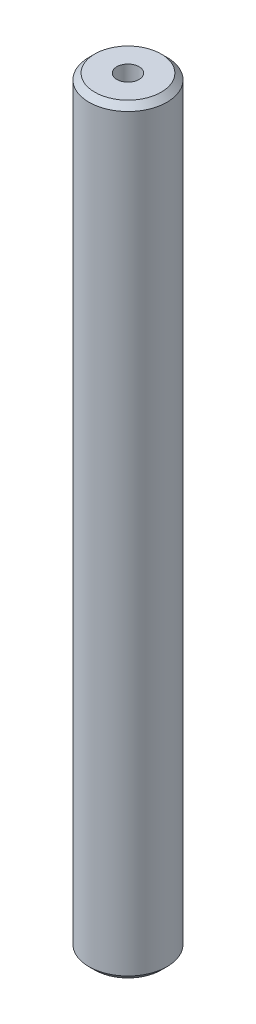
ISO-10303-21;
HEADER;
FILE_DESCRIPTION(('STEP AP214'),'2;1');
FILE_NAME('part.step','',(''),(''),'','','');
FILE_SCHEMA(('AUTOMOTIVE_DESIGN { 1 0 10303 214 1 1 1 1 }'));
ENDSEC;
DATA;
#1=APPLICATION_CONTEXT('core data for automotive mechanical design processes');
#2=APPLICATION_PROTOCOL_DEFINITION('international standard','automotive_design',2000,#1);
#3=PRODUCT_CONTEXT('',#1,'mechanical');
#4=PRODUCT('Part','Part','',(#3));
#5=PRODUCT_RELATED_PRODUCT_CATEGORY('part','',(#4));
#6=PRODUCT_DEFINITION_FORMATION('','',#4);
#7=PRODUCT_DEFINITION_CONTEXT('part definition',#1,'design');
#8=PRODUCT_DEFINITION('design','',#6,#7);
#9=PRODUCT_DEFINITION_SHAPE('','',#8);
#10=(LENGTH_UNIT() NAMED_UNIT(*) SI_UNIT(.MILLI.,.METRE.));
#11=(NAMED_UNIT(*) PLANE_ANGLE_UNIT() SI_UNIT($,.RADIAN.));
#12=(NAMED_UNIT(*) SI_UNIT($,.STERADIAN.) SOLID_ANGLE_UNIT());
#13=UNCERTAINTY_MEASURE_WITH_UNIT(LENGTH_MEASURE(1.E-05),#10,'distance_accuracy_value','');
#14=(GEOMETRIC_REPRESENTATION_CONTEXT(3) GLOBAL_UNCERTAINTY_ASSIGNED_CONTEXT((#13)) GLOBAL_UNIT_ASSIGNED_CONTEXT((#10,
#11,#12)) REPRESENTATION_CONTEXT('',''));
#15=CARTESIAN_POINT('',(0.,0.,0.));
#16=DIRECTION('',(0.,0.,1.));
#17=DIRECTION('',(1.,0.,0.));
#18=AXIS2_PLACEMENT_3D('',#15,#16,#17);
#19=CARTESIAN_POINT('',(0.,97.5659684433957,0.));
#20=DIRECTION('',(0.,-1.,0.));
#21=DIRECTION('',(0.,0.,-1.));
#22=AXIS2_PLACEMENT_3D('',#19,#20,#21);
#23=CYLINDRICAL_SURFACE('',#22,5.);
#24=CARTESIAN_POINT('',(0.,96.8245334853273,0.));
#25=DIRECTION('',(0.,1.,0.));
#26=DIRECTION('',(0.,0.,1.));
#27=AXIS2_PLACEMENT_3D('',#24,#25,#26);
#28=CIRCLE('',#27,5.);
#29=CARTESIAN_POINT('',(0.,96.8245334853273,5.));
#30=VERTEX_POINT('',#29);
#31=EDGE_CURVE('E50',#30,#30,#28,.F.);
#32=ORIENTED_EDGE('',*,*,#31,.T.);
#33=EDGE_LOOP('',(#32));
#34=FACE_BOUND('',#33,.T.);
#35=CARTESIAN_POINT('',(0.,0.741434958068429,0.));
#36=DIRECTION('',(0.,1.,0.));
#37=DIRECTION('',(0.,0.,1.));
#38=AXIS2_PLACEMENT_3D('',#35,#36,#37);
#39=CIRCLE('',#38,5.);
#40=CARTESIAN_POINT('',(0.,0.741434958068429,5.));
#41=VERTEX_POINT('',#40);
#42=EDGE_CURVE('E51',#41,#41,#39,.T.);
#43=ORIENTED_EDGE('',*,*,#42,.T.);
#44=EDGE_LOOP('',(#43));
#45=FACE_BOUND('',#44,.T.);
#46=ADVANCED_FACE('F39',(#34,#45),#23,.T.);
#47=CARTESIAN_POINT('',(0.,97.5659684433957,0.));
#48=DIRECTION('',(0.,1.,0.));
#49=DIRECTION('',(0.,0.,1.));
#50=AXIS2_PLACEMENT_3D('',#47,#48,#49);
#51=PLANE('',#50);
#52=CARTESIAN_POINT('',(0.,97.5659684433957,0.));
#53=DIRECTION('',(0.,1.,0.));
#54=DIRECTION('',(0.,0.,1.));
#55=AXIS2_PLACEMENT_3D('',#52,#53,#54);
#56=CIRCLE('',#55,4.25856504193155);
#57=CARTESIAN_POINT('',(0.,97.5659684433957,4.25856504193155));
#58=VERTEX_POINT('',#57);
#59=EDGE_CURVE('E54',#58,#58,#56,.T.);
#60=ORIENTED_EDGE('',*,*,#59,.T.);
#61=EDGE_LOOP('',(#60));
#62=FACE_BOUND('',#61,.T.);
#63=CARTESIAN_POINT('',(0.,97.5659684433957,0.));
#64=DIRECTION('',(0.,1.,0.));
#65=DIRECTION('',(0.,0.,1.));
#66=AXIS2_PLACEMENT_3D('',#63,#64,#65);
#67=CIRCLE('',#66,1.42770499549632);
#68=CARTESIAN_POINT('',(0.,97.5659684433957,1.42770499549632));
#69=VERTEX_POINT('',#68);
#70=EDGE_CURVE('E58',#69,#69,#67,.T.);
#71=ORIENTED_EDGE('',*,*,#70,.F.);
#72=EDGE_LOOP('',(#71));
#73=FACE_BOUND('',#72,.T.);
#74=ADVANCED_FACE('F69',(#62,#73),#51,.T.);
#75=CARTESIAN_POINT('',(0.,0.,0.));
#76=DIRECTION('',(0.,1.,0.));
#77=DIRECTION('',(0.,0.,1.));
#78=AXIS2_PLACEMENT_3D('',#75,#76,#77);
#79=PLANE('',#78);
#80=CARTESIAN_POINT('',(0.,0.,0.));
#81=DIRECTION('',(0.,1.,0.));
#82=DIRECTION('',(0.,0.,1.));
#83=AXIS2_PLACEMENT_3D('',#80,#81,#82);
#84=CIRCLE('',#83,4.25856504193155);
#85=CARTESIAN_POINT('',(0.,0.,4.25856504193155));
#86=VERTEX_POINT('',#85);
#87=EDGE_CURVE('E10',#86,#86,#84,.F.);
#88=ORIENTED_EDGE('',*,*,#87,.T.);
#89=EDGE_LOOP('',(#88));
#90=FACE_BOUND('',#89,.T.);
#91=CARTESIAN_POINT('',(0.,0.,0.));
#92=DIRECTION('',(0.,1.,0.));
#93=DIRECTION('',(0.,0.,1.));
#94=AXIS2_PLACEMENT_3D('',#91,#92,#93);
#95=CIRCLE('',#94,1.42770499549632);
#96=CARTESIAN_POINT('',(0.,0.,1.42770499549632));
#97=VERTEX_POINT('',#96);
#98=EDGE_CURVE('E63',#97,#97,#95,.T.);
#99=ORIENTED_EDGE('',*,*,#98,.T.);
#100=EDGE_LOOP('',(#99));
#101=FACE_BOUND('',#100,.T.);
#102=ADVANCED_FACE('F75',(#90,#101),#79,.F.);
#103=CARTESIAN_POINT('',(0.,97.5659684433957,0.));
#104=DIRECTION('',(0.,-1.,0.));
#105=DIRECTION('',(0.,0.,-1.));
#106=AXIS2_PLACEMENT_3D('',#103,#104,#105);
#107=CYLINDRICAL_SURFACE('',#106,1.42770499549632);
#108=ORIENTED_EDGE('',*,*,#70,.T.);
#109=EDGE_LOOP('',(#108));
#110=FACE_BOUND('',#109,.T.);
#111=ORIENTED_EDGE('',*,*,#98,.F.);
#112=EDGE_LOOP('',(#111));
#113=FACE_BOUND('',#112,.T.);
#114=ADVANCED_FACE('F70',(#110,#113),#107,.F.);
#115=CARTESIAN_POINT('',(0.,97.5659684433957,0.));
#116=DIRECTION('',(0.,-1.,0.));
#117=DIRECTION('',(0.,0.,-1.));
#118=AXIS2_PLACEMENT_3D('',#115,#116,#117);
#119=CONICAL_SURFACE('',#118,4.25856504193155,0.785398163397455);
#120=ORIENTED_EDGE('',*,*,#31,.F.);
#121=EDGE_LOOP('',(#120));
#122=FACE_BOUND('',#121,.T.);
#123=ORIENTED_EDGE('',*,*,#59,.F.);
#124=EDGE_LOOP('',(#123));
#125=FACE_BOUND('',#124,.T.);
#126=ADVANCED_FACE('F81',(#122,#125),#119,.T.);
#127=CARTESIAN_POINT('',(0.,0.741434958068429,0.));
#128=DIRECTION('',(0.,1.,0.));
#129=DIRECTION('',(0.,0.,1.));
#130=AXIS2_PLACEMENT_3D('',#127,#128,#129);
#131=CONICAL_SURFACE('',#130,5.,0.785398163397464);
#132=ORIENTED_EDGE('',*,*,#87,.F.);
#133=EDGE_LOOP('',(#132));
#134=FACE_BOUND('',#133,.T.);
#135=ORIENTED_EDGE('',*,*,#42,.F.);
#136=EDGE_LOOP('',(#135));
#137=FACE_BOUND('',#136,.T.);
#138=ADVANCED_FACE('F45',(#134,#137),#131,.T.);
#139=CLOSED_SHELL('',(#46,#74,#102,#114,#126,#138));
#140=MANIFOLD_SOLID_BREP('B2',#139);
#141=ADVANCED_BREP_SHAPE_REPRESENTATION('',(#18,#140),#14);
#142=SHAPE_DEFINITION_REPRESENTATION(#9,#141);
ENDSEC;
END-ISO-10303-21;
